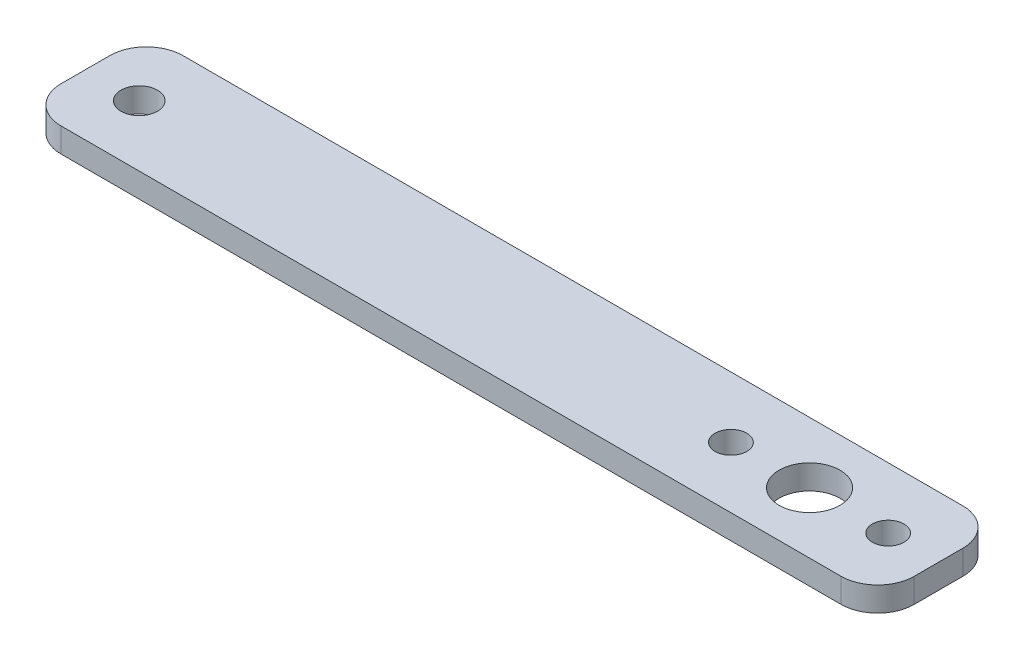
ISO-10303-21;
HEADER;
FILE_DESCRIPTION(('STEP AP214'),'2;1');
FILE_NAME('part.step','',(''),(''),'','','');
FILE_SCHEMA(('AUTOMOTIVE_DESIGN { 1 0 10303 214 1 1 1 1 }'));
ENDSEC;
DATA;
#1=APPLICATION_CONTEXT('core data for automotive mechanical design processes');
#2=APPLICATION_PROTOCOL_DEFINITION('international standard','automotive_design',2000,#1);
#3=PRODUCT_CONTEXT('',#1,'mechanical');
#4=PRODUCT('Part','Part','',(#3));
#5=PRODUCT_RELATED_PRODUCT_CATEGORY('part','',(#4));
#6=PRODUCT_DEFINITION_FORMATION('','',#4);
#7=PRODUCT_DEFINITION_CONTEXT('part definition',#1,'design');
#8=PRODUCT_DEFINITION('design','',#6,#7);
#9=PRODUCT_DEFINITION_SHAPE('','',#8);
#10=(LENGTH_UNIT() NAMED_UNIT(*) SI_UNIT(.MILLI.,.METRE.));
#11=(NAMED_UNIT(*) PLANE_ANGLE_UNIT() SI_UNIT($,.RADIAN.));
#12=(NAMED_UNIT(*) SI_UNIT($,.STERADIAN.) SOLID_ANGLE_UNIT());
#13=UNCERTAINTY_MEASURE_WITH_UNIT(LENGTH_MEASURE(1.E-05),#10,'distance_accuracy_value','');
#14=(GEOMETRIC_REPRESENTATION_CONTEXT(3) GLOBAL_UNCERTAINTY_ASSIGNED_CONTEXT((#13)) GLOBAL_UNIT_ASSIGNED_CONTEXT((#10,
#11,#12)) REPRESENTATION_CONTEXT('',''));
#15=CARTESIAN_POINT('',(0.,0.,0.));
#16=DIRECTION('',(0.,0.,1.));
#17=DIRECTION('',(1.,0.,0.));
#18=AXIS2_PLACEMENT_3D('',#15,#16,#17);
#19=CARTESIAN_POINT('',(35.,2.,-5.));
#20=DIRECTION('',(-1.,0.,0.));
#21=DIRECTION('',(0.,0.,1.));
#22=AXIS2_PLACEMENT_3D('',#19,#20,#21);
#23=PLANE('',#22);
#24=DIRECTION('',(0.,0.,-1.));
#25=VECTOR('',#24,1.);
#26=CARTESIAN_POINT('',(35.,2.,-5.));
#27=LINE('',#26,#25);
#28=CARTESIAN_POINT('',(35.,2.,2.));
#29=VERTEX_POINT('',#28);
#30=CARTESIAN_POINT('',(35.,2.,-2.));
#31=VERTEX_POINT('',#30);
#32=EDGE_CURVE('E128',#29,#31,#27,.T.);
#33=ORIENTED_EDGE('',*,*,#32,.F.);
#34=DIRECTION('',(0.,-1.,0.));
#35=VECTOR('',#34,1.);
#36=CARTESIAN_POINT('',(35.,2.,2.));
#37=LINE('',#36,#35);
#38=CARTESIAN_POINT('',(35.,0.,2.));
#39=VERTEX_POINT('',#38);
#40=EDGE_CURVE('E11',#29,#39,#37,.T.);
#41=ORIENTED_EDGE('',*,*,#40,.T.);
#42=DIRECTION('',(0.,0.,-1.));
#43=VECTOR('',#42,1.);
#44=CARTESIAN_POINT('',(35.,0.,-5.));
#45=LINE('',#44,#43);
#46=CARTESIAN_POINT('',(35.,0.,-2.));
#47=VERTEX_POINT('',#46);
#48=EDGE_CURVE('E130',#39,#47,#45,.T.);
#49=ORIENTED_EDGE('',*,*,#48,.T.);
#50=DIRECTION('',(0.,-1.,0.));
#51=VECTOR('',#50,1.);
#52=CARTESIAN_POINT('',(35.,2.,-2.));
#53=LINE('',#52,#51);
#54=EDGE_CURVE('E41',#47,#31,#53,.F.);
#55=ORIENTED_EDGE('',*,*,#54,.T.);
#56=EDGE_LOOP('',(#33,#41,#49,#55));
#57=FACE_BOUND('',#56,.T.);
#58=ADVANCED_FACE('F33',(#57),#23,.F.);
#59=CARTESIAN_POINT('',(-35.,2.,-5.));
#60=DIRECTION('',(0.,0.,1.));
#61=DIRECTION('',(1.,0.,0.));
#62=AXIS2_PLACEMENT_3D('',#59,#60,#61);
#63=PLANE('',#62);
#64=DIRECTION('',(-1.,0.,0.));
#65=VECTOR('',#64,1.);
#66=CARTESIAN_POINT('',(-35.,0.,-5.));
#67=LINE('',#66,#65);
#68=CARTESIAN_POINT('',(32.,0.,-5.));
#69=VERTEX_POINT('',#68);
#70=CARTESIAN_POINT('',(-32.,0.,-5.));
#71=VERTEX_POINT('',#70);
#72=EDGE_CURVE('E126',#69,#71,#67,.T.);
#73=ORIENTED_EDGE('',*,*,#72,.T.);
#74=DIRECTION('',(0.,-1.,0.));
#75=VECTOR('',#74,1.);
#76=CARTESIAN_POINT('',(-32.,2.,-5.));
#77=LINE('',#76,#75);
#78=CARTESIAN_POINT('',(-32.,2.,-5.));
#79=VERTEX_POINT('',#78);
#80=EDGE_CURVE('E105',#71,#79,#77,.F.);
#81=ORIENTED_EDGE('',*,*,#80,.T.);
#82=DIRECTION('',(-1.,0.,0.));
#83=VECTOR('',#82,1.);
#84=CARTESIAN_POINT('',(-35.,2.,-5.));
#85=LINE('',#84,#83);
#86=CARTESIAN_POINT('',(32.,2.,-5.));
#87=VERTEX_POINT('',#86);
#88=EDGE_CURVE('E174',#87,#79,#85,.T.);
#89=ORIENTED_EDGE('',*,*,#88,.F.);
#90=DIRECTION('',(0.,-1.,0.));
#91=VECTOR('',#90,1.);
#92=CARTESIAN_POINT('',(32.,2.,-5.));
#93=LINE('',#92,#91);
#94=EDGE_CURVE('E110',#87,#69,#93,.T.);
#95=ORIENTED_EDGE('',*,*,#94,.T.);
#96=EDGE_LOOP('',(#73,#81,#89,#95));
#97=FACE_BOUND('',#96,.T.);
#98=ADVANCED_FACE('F178',(#97),#63,.F.);
#99=CARTESIAN_POINT('',(-35.,2.,-5.));
#100=DIRECTION('',(1.,0.,0.));
#101=DIRECTION('',(0.,0.,-1.));
#102=AXIS2_PLACEMENT_3D('',#99,#100,#101);
#103=PLANE('',#102);
#104=DIRECTION('',(0.,0.,1.));
#105=VECTOR('',#104,1.);
#106=CARTESIAN_POINT('',(-35.,2.,-5.));
#107=LINE('',#106,#105);
#108=CARTESIAN_POINT('',(-35.,2.,-2.));
#109=VERTEX_POINT('',#108);
#110=CARTESIAN_POINT('',(-35.,2.,2.));
#111=VERTEX_POINT('',#110);
#112=EDGE_CURVE('E119',#109,#111,#107,.T.);
#113=ORIENTED_EDGE('',*,*,#112,.F.);
#114=DIRECTION('',(0.,-1.,0.));
#115=VECTOR('',#114,1.);
#116=CARTESIAN_POINT('',(-35.,2.,-2.));
#117=LINE('',#116,#115);
#118=CARTESIAN_POINT('',(-35.,0.,-2.));
#119=VERTEX_POINT('',#118);
#120=EDGE_CURVE('E104',#109,#119,#117,.T.);
#121=ORIENTED_EDGE('',*,*,#120,.T.);
#122=DIRECTION('',(0.,0.,1.));
#123=VECTOR('',#122,1.);
#124=CARTESIAN_POINT('',(-35.,0.,-5.));
#125=LINE('',#124,#123);
#126=CARTESIAN_POINT('',(-35.,0.,2.));
#127=VERTEX_POINT('',#126);
#128=EDGE_CURVE('E117',#119,#127,#125,.T.);
#129=ORIENTED_EDGE('',*,*,#128,.T.);
#130=DIRECTION('',(0.,-1.,0.));
#131=VECTOR('',#130,1.);
#132=CARTESIAN_POINT('',(-35.,2.,2.));
#133=LINE('',#132,#131);
#134=EDGE_CURVE('E121',#127,#111,#133,.F.);
#135=ORIENTED_EDGE('',*,*,#134,.T.);
#136=EDGE_LOOP('',(#113,#121,#129,#135));
#137=FACE_BOUND('',#136,.T.);
#138=ADVANCED_FACE('F116',(#137),#103,.F.);
#139=CARTESIAN_POINT('',(-35.,2.,5.));
#140=DIRECTION('',(0.,0.,-1.));
#141=DIRECTION('',(-1.,0.,0.));
#142=AXIS2_PLACEMENT_3D('',#139,#140,#141);
#143=PLANE('',#142);
#144=DIRECTION('',(1.,0.,0.));
#145=VECTOR('',#144,1.);
#146=CARTESIAN_POINT('',(-35.,2.,5.));
#147=LINE('',#146,#145);
#148=CARTESIAN_POINT('',(-32.,2.,5.));
#149=VERTEX_POINT('',#148);
#150=CARTESIAN_POINT('',(32.,2.,5.));
#151=VERTEX_POINT('',#150);
#152=EDGE_CURVE('E142',#149,#151,#147,.T.);
#153=ORIENTED_EDGE('',*,*,#152,.F.);
#154=DIRECTION('',(0.,-1.,0.));
#155=VECTOR('',#154,1.);
#156=CARTESIAN_POINT('',(-32.,2.,5.));
#157=LINE('',#156,#155);
#158=CARTESIAN_POINT('',(-32.,0.,5.));
#159=VERTEX_POINT('',#158);
#160=EDGE_CURVE('E159',#149,#159,#157,.T.);
#161=ORIENTED_EDGE('',*,*,#160,.T.);
#162=DIRECTION('',(1.,0.,0.));
#163=VECTOR('',#162,1.);
#164=CARTESIAN_POINT('',(-35.,0.,5.));
#165=LINE('',#164,#163);
#166=CARTESIAN_POINT('',(32.,0.,5.));
#167=VERTEX_POINT('',#166);
#168=EDGE_CURVE('E125',#159,#167,#165,.T.);
#169=ORIENTED_EDGE('',*,*,#168,.T.);
#170=DIRECTION('',(0.,-1.,0.));
#171=VECTOR('',#170,1.);
#172=CARTESIAN_POINT('',(32.,2.,5.));
#173=LINE('',#172,#171);
#174=EDGE_CURVE('E48',#167,#151,#173,.F.);
#175=ORIENTED_EDGE('',*,*,#174,.T.);
#176=EDGE_LOOP('',(#153,#161,#169,#175));
#177=FACE_BOUND('',#176,.T.);
#178=ADVANCED_FACE('F205',(#177),#143,.F.);
#179=CARTESIAN_POINT('',(0.,2.,0.));
#180=DIRECTION('',(0.,1.,0.));
#181=DIRECTION('',(0.,0.,1.));
#182=AXIS2_PLACEMENT_3D('',#179,#180,#181);
#183=PLANE('',#182);
#184=CARTESIAN_POINT('',(17.9638831521923,2.,0.));
#185=DIRECTION('',(0.,1.,0.));
#186=DIRECTION('',(0.,0.,-1.));
#187=AXIS2_PLACEMENT_3D('',#184,#185,#186);
#188=CIRCLE('',#187,1.3);
#189=CARTESIAN_POINT('',(17.9638831521923,2.,-1.3));
#190=VERTEX_POINT('',#189);
#191=EDGE_CURVE('E138',#190,#190,#188,.T.);
#192=ORIENTED_EDGE('',*,*,#191,.F.);
#193=EDGE_LOOP('',(#192));
#194=FACE_BOUND('',#193,.T.);
#195=CARTESIAN_POINT('',(30.8638831521923,2.,0.));
#196=DIRECTION('',(0.,1.,0.));
#197=DIRECTION('',(0.,0.,1.));
#198=AXIS2_PLACEMENT_3D('',#195,#196,#197);
#199=CIRCLE('',#198,1.3);
#200=CARTESIAN_POINT('',(30.8638831521923,2.,1.3));
#201=VERTEX_POINT('',#200);
#202=EDGE_CURVE('E194',#201,#201,#199,.T.);
#203=ORIENTED_EDGE('',*,*,#202,.F.);
#204=EDGE_LOOP('',(#203));
#205=FACE_BOUND('',#204,.T.);
#206=CARTESIAN_POINT('',(-30.5861168478077,2.,0.));
#207=DIRECTION('',(0.,1.,0.));
#208=DIRECTION('',(0.,0.,1.));
#209=AXIS2_PLACEMENT_3D('',#206,#207,#208);
#210=CIRCLE('',#209,1.49999999999999);
#211=CARTESIAN_POINT('',(-30.5861168478077,2.,1.49999999999999));
#212=VERTEX_POINT('',#211);
#213=EDGE_CURVE('E141',#212,#212,#210,.T.);
#214=ORIENTED_EDGE('',*,*,#213,.F.);
#215=EDGE_LOOP('',(#214));
#216=FACE_BOUND('',#215,.T.);
#217=CARTESIAN_POINT('',(24.4138831521923,2.,0.));
#218=DIRECTION('',(0.,1.,0.));
#219=DIRECTION('',(0.,0.,1.));
#220=AXIS2_PLACEMENT_3D('',#217,#218,#219);
#221=CIRCLE('',#220,2.49999999999999);
#222=CARTESIAN_POINT('',(24.4138831521923,2.,2.49999999999999));
#223=VERTEX_POINT('',#222);
#224=EDGE_CURVE('E181',#223,#223,#221,.T.);
#225=ORIENTED_EDGE('',*,*,#224,.F.);
#226=EDGE_LOOP('',(#225));
#227=FACE_BOUND('',#226,.T.);
#228=ORIENTED_EDGE('',*,*,#88,.T.);
#229=CARTESIAN_POINT('',(-32.,2.,-2.));
#230=DIRECTION('',(0.,1.,0.));
#231=DIRECTION('',(0.,0.,1.));
#232=AXIS2_PLACEMENT_3D('',#229,#230,#231);
#233=CIRCLE('',#232,3.);
#234=EDGE_CURVE('E156',#79,#109,#233,.T.);
#235=ORIENTED_EDGE('',*,*,#234,.T.);
#236=ORIENTED_EDGE('',*,*,#112,.T.);
#237=CARTESIAN_POINT('',(-32.,2.,2.));
#238=DIRECTION('',(0.,1.,0.));
#239=DIRECTION('',(0.,0.,1.));
#240=AXIS2_PLACEMENT_3D('',#237,#238,#239);
#241=CIRCLE('',#240,3.);
#242=EDGE_CURVE('E55',#111,#149,#241,.T.);
#243=ORIENTED_EDGE('',*,*,#242,.T.);
#244=ORIENTED_EDGE('',*,*,#152,.T.);
#245=CARTESIAN_POINT('',(32.,2.,2.));
#246=DIRECTION('',(0.,1.,0.));
#247=DIRECTION('',(0.,0.,1.));
#248=AXIS2_PLACEMENT_3D('',#245,#246,#247);
#249=CIRCLE('',#248,3.);
#250=EDGE_CURVE('E153',#151,#29,#249,.T.);
#251=ORIENTED_EDGE('',*,*,#250,.T.);
#252=ORIENTED_EDGE('',*,*,#32,.T.);
#253=CARTESIAN_POINT('',(32.,2.,-2.));
#254=DIRECTION('',(0.,1.,0.));
#255=DIRECTION('',(0.,0.,1.));
#256=AXIS2_PLACEMENT_3D('',#253,#254,#255);
#257=CIRCLE('',#256,3.);
#258=EDGE_CURVE('E151',#31,#87,#257,.T.);
#259=ORIENTED_EDGE('',*,*,#258,.T.);
#260=EDGE_LOOP('',(#228,#235,#236,#243,#244,#251,#252,#259));
#261=FACE_BOUND('',#260,.T.);
#262=ADVANCED_FACE('F171',(#194,#205,#216,#227,#261),#183,.T.);
#263=CARTESIAN_POINT('',(0.,0.,0.));
#264=DIRECTION('',(0.,1.,0.));
#265=DIRECTION('',(0.,0.,1.));
#266=AXIS2_PLACEMENT_3D('',#263,#264,#265);
#267=PLANE('',#266);
#268=CARTESIAN_POINT('',(17.9638831521923,0.,0.));
#269=DIRECTION('',(0.,1.,0.));
#270=DIRECTION('',(0.,0.,1.));
#271=AXIS2_PLACEMENT_3D('',#268,#269,#270);
#272=CIRCLE('',#271,1.3);
#273=CARTESIAN_POINT('',(17.9638831521923,0.,1.3));
#274=VERTEX_POINT('',#273);
#275=EDGE_CURVE('E137',#274,#274,#272,.T.);
#276=ORIENTED_EDGE('',*,*,#275,.T.);
#277=EDGE_LOOP('',(#276));
#278=FACE_BOUND('',#277,.T.);
#279=CARTESIAN_POINT('',(30.8638831521923,0.,0.));
#280=DIRECTION('',(0.,1.,0.));
#281=DIRECTION('',(0.,0.,1.));
#282=AXIS2_PLACEMENT_3D('',#279,#280,#281);
#283=CIRCLE('',#282,1.3);
#284=CARTESIAN_POINT('',(30.8638831521923,0.,1.3));
#285=VERTEX_POINT('',#284);
#286=EDGE_CURVE('E134',#285,#285,#283,.T.);
#287=ORIENTED_EDGE('',*,*,#286,.T.);
#288=EDGE_LOOP('',(#287));
#289=FACE_BOUND('',#288,.T.);
#290=CARTESIAN_POINT('',(-30.5861168478077,0.,0.));
#291=DIRECTION('',(0.,1.,0.));
#292=DIRECTION('',(0.,0.,1.));
#293=AXIS2_PLACEMENT_3D('',#290,#291,#292);
#294=CIRCLE('',#293,1.5);
#295=CARTESIAN_POINT('',(-30.5861168478077,0.,1.5));
#296=VERTEX_POINT('',#295);
#297=EDGE_CURVE('E189',#296,#296,#294,.T.);
#298=ORIENTED_EDGE('',*,*,#297,.T.);
#299=EDGE_LOOP('',(#298));
#300=FACE_BOUND('',#299,.T.);
#301=CARTESIAN_POINT('',(24.4138831521923,0.,0.));
#302=DIRECTION('',(0.,1.,0.));
#303=DIRECTION('',(0.,0.,1.));
#304=AXIS2_PLACEMENT_3D('',#301,#302,#303);
#305=CIRCLE('',#304,2.49999999999999);
#306=CARTESIAN_POINT('',(24.4138831521923,0.,2.49999999999999));
#307=VERTEX_POINT('',#306);
#308=EDGE_CURVE('E179',#307,#307,#305,.T.);
#309=ORIENTED_EDGE('',*,*,#308,.T.);
#310=EDGE_LOOP('',(#309));
#311=FACE_BOUND('',#310,.T.);
#312=ORIENTED_EDGE('',*,*,#128,.F.);
#313=CARTESIAN_POINT('',(-32.,0.,-2.));
#314=DIRECTION('',(0.,1.,0.));
#315=DIRECTION('',(0.,0.,1.));
#316=AXIS2_PLACEMENT_3D('',#313,#314,#315);
#317=CIRCLE('',#316,3.);
#318=EDGE_CURVE('E100',#119,#71,#317,.F.);
#319=ORIENTED_EDGE('',*,*,#318,.T.);
#320=ORIENTED_EDGE('',*,*,#72,.F.);
#321=CARTESIAN_POINT('',(32.,0.,-2.));
#322=DIRECTION('',(0.,1.,0.));
#323=DIRECTION('',(0.,0.,1.));
#324=AXIS2_PLACEMENT_3D('',#321,#322,#323);
#325=CIRCLE('',#324,3.);
#326=EDGE_CURVE('E120',#69,#47,#325,.F.);
#327=ORIENTED_EDGE('',*,*,#326,.T.);
#328=ORIENTED_EDGE('',*,*,#48,.F.);
#329=CARTESIAN_POINT('',(32.,0.,2.));
#330=DIRECTION('',(0.,1.,0.));
#331=DIRECTION('',(0.,0.,1.));
#332=AXIS2_PLACEMENT_3D('',#329,#330,#331);
#333=CIRCLE('',#332,3.);
#334=EDGE_CURVE('E145',#39,#167,#333,.F.);
#335=ORIENTED_EDGE('',*,*,#334,.T.);
#336=ORIENTED_EDGE('',*,*,#168,.F.);
#337=CARTESIAN_POINT('',(-32.,0.,2.));
#338=DIRECTION('',(0.,1.,0.));
#339=DIRECTION('',(0.,0.,1.));
#340=AXIS2_PLACEMENT_3D('',#337,#338,#339);
#341=CIRCLE('',#340,3.);
#342=EDGE_CURVE('E111',#159,#127,#341,.F.);
#343=ORIENTED_EDGE('',*,*,#342,.T.);
#344=EDGE_LOOP('',(#312,#319,#320,#327,#328,#335,#336,#343));
#345=FACE_BOUND('',#344,.T.);
#346=ADVANCED_FACE('F123',(#278,#289,#300,#311,#345),#267,.F.);
#347=CARTESIAN_POINT('',(24.4138831521923,2.,0.));
#348=DIRECTION('',(0.,1.,0.));
#349=DIRECTION('',(0.,0.,1.));
#350=AXIS2_PLACEMENT_3D('',#347,#348,#349);
#351=CYLINDRICAL_SURFACE('',#350,2.49999999999999);
#352=ORIENTED_EDGE('',*,*,#308,.F.);
#353=EDGE_LOOP('',(#352));
#354=FACE_BOUND('',#353,.T.);
#355=ORIENTED_EDGE('',*,*,#224,.T.);
#356=EDGE_LOOP('',(#355));
#357=FACE_BOUND('',#356,.T.);
#358=ADVANCED_FACE('F213',(#354,#357),#351,.F.);
#359=CARTESIAN_POINT('',(-30.5861168478077,2.,0.));
#360=DIRECTION('',(0.,1.,0.));
#361=DIRECTION('',(0.,0.,1.));
#362=AXIS2_PLACEMENT_3D('',#359,#360,#361);
#363=CYLINDRICAL_SURFACE('',#362,1.49999999999999);
#364=ORIENTED_EDGE('',*,*,#297,.F.);
#365=EDGE_LOOP('',(#364));
#366=FACE_BOUND('',#365,.T.);
#367=ORIENTED_EDGE('',*,*,#213,.T.);
#368=EDGE_LOOP('',(#367));
#369=FACE_BOUND('',#368,.T.);
#370=ADVANCED_FACE('F215',(#366,#369),#363,.F.);
#371=CARTESIAN_POINT('',(30.8638831521923,-1.,0.));
#372=DIRECTION('',(0.,1.,0.));
#373=DIRECTION('',(0.,0.,1.));
#374=AXIS2_PLACEMENT_3D('',#371,#372,#373);
#375=CYLINDRICAL_SURFACE('',#374,1.3);
#376=ORIENTED_EDGE('',*,*,#202,.T.);
#377=EDGE_LOOP('',(#376));
#378=FACE_BOUND('',#377,.T.);
#379=ORIENTED_EDGE('',*,*,#286,.F.);
#380=EDGE_LOOP('',(#379));
#381=FACE_BOUND('',#380,.T.);
#382=ADVANCED_FACE('F222',(#378,#381),#375,.F.);
#383=CARTESIAN_POINT('',(17.9638831521923,-1.,0.));
#384=DIRECTION('',(0.,1.,0.));
#385=DIRECTION('',(0.,0.,1.));
#386=AXIS2_PLACEMENT_3D('',#383,#384,#385);
#387=CYLINDRICAL_SURFACE('',#386,1.3);
#388=ORIENTED_EDGE('',*,*,#191,.T.);
#389=EDGE_LOOP('',(#388));
#390=FACE_BOUND('',#389,.T.);
#391=ORIENTED_EDGE('',*,*,#275,.F.);
#392=EDGE_LOOP('',(#391));
#393=FACE_BOUND('',#392,.T.);
#394=ADVANCED_FACE('F200',(#390,#393),#387,.F.);
#395=CARTESIAN_POINT('',(-32.,2.,-2.));
#396=DIRECTION('',(0.,-1.,0.));
#397=DIRECTION('',(0.,0.,-1.));
#398=AXIS2_PLACEMENT_3D('',#395,#396,#397);
#399=CYLINDRICAL_SURFACE('',#398,3.);
#400=ORIENTED_EDGE('',*,*,#234,.F.);
#401=ORIENTED_EDGE('',*,*,#80,.F.);
#402=ORIENTED_EDGE('',*,*,#318,.F.);
#403=ORIENTED_EDGE('',*,*,#120,.F.);
#404=EDGE_LOOP('',(#400,#401,#402,#403));
#405=FACE_BOUND('',#404,.T.);
#406=ADVANCED_FACE('F103',(#405),#399,.T.);
#407=CARTESIAN_POINT('',(-32.,2.,2.));
#408=DIRECTION('',(0.,-1.,0.));
#409=DIRECTION('',(0.,0.,-1.));
#410=AXIS2_PLACEMENT_3D('',#407,#408,#409);
#411=CYLINDRICAL_SURFACE('',#410,3.);
#412=ORIENTED_EDGE('',*,*,#242,.F.);
#413=ORIENTED_EDGE('',*,*,#134,.F.);
#414=ORIENTED_EDGE('',*,*,#342,.F.);
#415=ORIENTED_EDGE('',*,*,#160,.F.);
#416=EDGE_LOOP('',(#412,#413,#414,#415));
#417=FACE_BOUND('',#416,.T.);
#418=ADVANCED_FACE('F238',(#417),#411,.T.);
#419=CARTESIAN_POINT('',(32.,2.,2.));
#420=DIRECTION('',(0.,-1.,0.));
#421=DIRECTION('',(0.,0.,-1.));
#422=AXIS2_PLACEMENT_3D('',#419,#420,#421);
#423=CYLINDRICAL_SURFACE('',#422,3.);
#424=ORIENTED_EDGE('',*,*,#250,.F.);
#425=ORIENTED_EDGE('',*,*,#174,.F.);
#426=ORIENTED_EDGE('',*,*,#334,.F.);
#427=ORIENTED_EDGE('',*,*,#40,.F.);
#428=EDGE_LOOP('',(#424,#425,#426,#427));
#429=FACE_BOUND('',#428,.T.);
#430=ADVANCED_FACE('F240',(#429),#423,.T.);
#431=CARTESIAN_POINT('',(32.,2.,-2.));
#432=DIRECTION('',(0.,-1.,0.));
#433=DIRECTION('',(0.,0.,-1.));
#434=AXIS2_PLACEMENT_3D('',#431,#432,#433);
#435=CYLINDRICAL_SURFACE('',#434,3.);
#436=ORIENTED_EDGE('',*,*,#258,.F.);
#437=ORIENTED_EDGE('',*,*,#54,.F.);
#438=ORIENTED_EDGE('',*,*,#326,.F.);
#439=ORIENTED_EDGE('',*,*,#94,.F.);
#440=EDGE_LOOP('',(#436,#437,#438,#439));
#441=FACE_BOUND('',#440,.T.);
#442=ADVANCED_FACE('F35',(#441),#435,.T.);
#443=CLOSED_SHELL('',(#58,#98,#138,#178,#262,#346,#358,#370,#382,#394,#406,#418,#430,#442));
#444=MANIFOLD_SOLID_BREP('B2',#443);
#445=ADVANCED_BREP_SHAPE_REPRESENTATION('',(#18,#444),#14);
#446=SHAPE_DEFINITION_REPRESENTATION(#9,#445);
ENDSEC;
END-ISO-10303-21;
